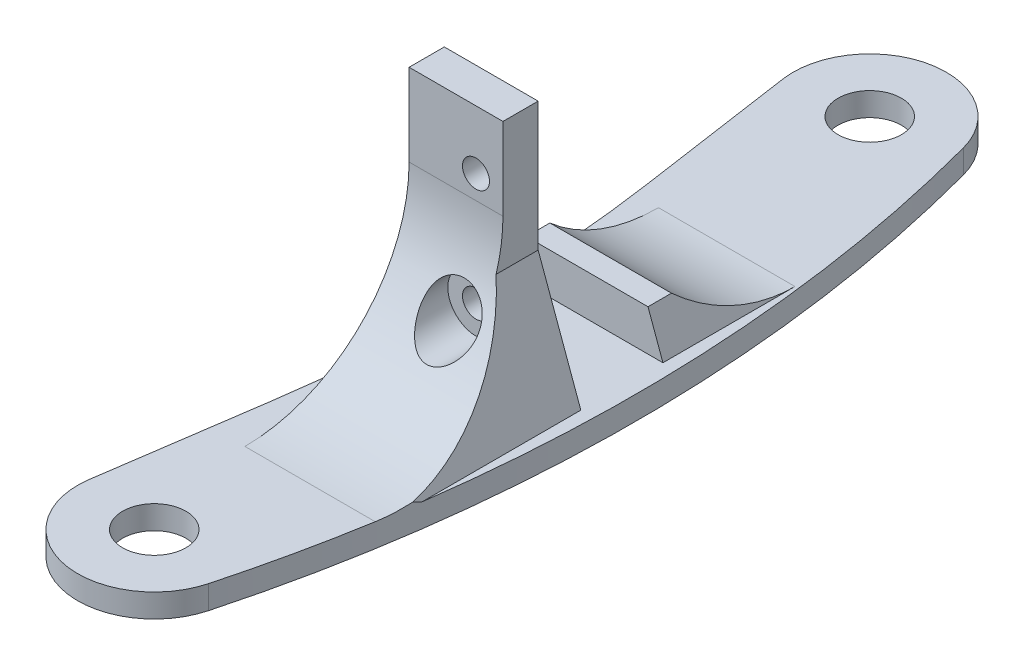
ISO-10303-21;
HEADER;
FILE_DESCRIPTION(('STEP AP214'),'2;1');
FILE_NAME('part.step','',(''),(''),'','','');
FILE_SCHEMA(('AUTOMOTIVE_DESIGN { 1 0 10303 214 1 1 1 1 }'));
ENDSEC;
DATA;
#1=APPLICATION_CONTEXT('core data for automotive mechanical design processes');
#2=APPLICATION_PROTOCOL_DEFINITION('international standard','automotive_design',2000,#1);
#3=PRODUCT_CONTEXT('',#1,'mechanical');
#4=PRODUCT('Part','Part','',(#3));
#5=PRODUCT_RELATED_PRODUCT_CATEGORY('part','',(#4));
#6=PRODUCT_DEFINITION_FORMATION('','',#4);
#7=PRODUCT_DEFINITION_CONTEXT('part definition',#1,'design');
#8=PRODUCT_DEFINITION('design','',#6,#7);
#9=PRODUCT_DEFINITION_SHAPE('','',#8);
#10=(LENGTH_UNIT() NAMED_UNIT(*) SI_UNIT(.MILLI.,.METRE.));
#11=(NAMED_UNIT(*) PLANE_ANGLE_UNIT() SI_UNIT($,.RADIAN.));
#12=(NAMED_UNIT(*) SI_UNIT($,.STERADIAN.) SOLID_ANGLE_UNIT());
#13=UNCERTAINTY_MEASURE_WITH_UNIT(LENGTH_MEASURE(1.E-05),#10,'distance_accuracy_value','');
#14=(GEOMETRIC_REPRESENTATION_CONTEXT(3) GLOBAL_UNCERTAINTY_ASSIGNED_CONTEXT((#13)) GLOBAL_UNIT_ASSIGNED_CONTEXT((#10,
#11,#12)) REPRESENTATION_CONTEXT('',''));
#15=CARTESIAN_POINT('',(0.,0.,0.));
#16=DIRECTION('',(0.,0.,1.));
#17=DIRECTION('',(1.,0.,0.));
#18=AXIS2_PLACEMENT_3D('',#15,#16,#17);
#19=CARTESIAN_POINT('',(8.7,8.4,3.));
#20=DIRECTION('',(0.,0.,-1.));
#21=DIRECTION('',(-1.,0.,0.));
#22=AXIS2_PLACEMENT_3D('',#19,#20,#21);
#23=CYLINDRICAL_SURFACE('',#22,1.15);
#24=CARTESIAN_POINT('',(8.7,8.4,0.));
#25=DIRECTION('',(0.,0.,1.));
#26=DIRECTION('',(1.,0.,0.));
#27=AXIS2_PLACEMENT_3D('',#24,#25,#26);
#28=CIRCLE('',#27,1.15);
#29=CARTESIAN_POINT('',(9.85,8.4,0.));
#30=VERTEX_POINT('',#29);
#31=EDGE_CURVE('E285',#30,#30,#28,.T.);
#32=ORIENTED_EDGE('',*,*,#31,.F.);
#33=EDGE_LOOP('',(#32));
#34=FACE_BOUND('',#33,.T.);
#35=CARTESIAN_POINT('',(8.7,8.4,3.));
#36=DIRECTION('',(0.,0.,1.));
#37=DIRECTION('',(1.,0.,0.));
#38=AXIS2_PLACEMENT_3D('',#35,#36,#37);
#39=CIRCLE('',#38,1.15);
#40=CARTESIAN_POINT('',(9.85,8.4,3.));
#41=VERTEX_POINT('',#40);
#42=EDGE_CURVE('E48',#41,#41,#39,.T.);
#43=ORIENTED_EDGE('',*,*,#42,.T.);
#44=EDGE_LOOP('',(#43));
#45=FACE_BOUND('',#44,.T.);
#46=ADVANCED_FACE('F43',(#34,#45),#23,.F.);
#47=CARTESIAN_POINT('',(0.,16.,17.));
#48=DIRECTION('',(-1.,0.,0.));
#49=DIRECTION('',(0.,0.,1.));
#50=AXIS2_PLACEMENT_3D('',#47,#48,#49);
#51=CYLINDRICAL_SURFACE('',#50,14.);
#52=CARTESIAN_POINT('',(11.,16.,17.));
#53=DIRECTION('',(1.,0.,0.));
#54=DIRECTION('',(0.,1.,0.));
#55=AXIS2_PLACEMENT_3D('',#52,#53,#54);
#56=CIRCLE('',#55,14.);
#57=CARTESIAN_POINT('',(11.,16.,3.));
#58=VERTEX_POINT('',#57);
#59=CARTESIAN_POINT('',(11.,12.,3.58359213500125));
#60=VERTEX_POINT('',#59);
#61=EDGE_CURVE('E346',#58,#60,#56,.F.);
#62=ORIENTED_EDGE('',*,*,#61,.F.);
#63=DIRECTION('',(-1.,0.,0.));
#64=VECTOR('',#63,1.);
#65=CARTESIAN_POINT('',(0.,16.,3.));
#66=LINE('',#65,#64);
#67=CARTESIAN_POINT('',(3.,16.,3.));
#68=VERTEX_POINT('',#67);
#69=EDGE_CURVE('E175',#68,#58,#66,.F.);
#70=ORIENTED_EDGE('',*,*,#69,.F.);
#71=CARTESIAN_POINT('',(3.,16.,17.));
#72=DIRECTION('',(1.,0.,0.));
#73=DIRECTION('',(0.,1.,0.));
#74=AXIS2_PLACEMENT_3D('',#71,#72,#73);
#75=CIRCLE('',#74,14.);
#76=CARTESIAN_POINT('',(3.,2.,17.));
#77=VERTEX_POINT('',#76);
#78=EDGE_CURVE('E174',#77,#68,#75,.T.);
#79=ORIENTED_EDGE('',*,*,#78,.F.);
#80=DIRECTION('',(-1.,0.,0.));
#81=VECTOR('',#80,1.);
#82=CARTESIAN_POINT('',(0.,2.,17.));
#83=LINE('',#82,#81);
#84=CARTESIAN_POINT('',(14.1115614011774,2.,17.));
#85=VERTEX_POINT('',#84);
#86=EDGE_CURVE('E336',#85,#77,#83,.T.);
#87=ORIENTED_EDGE('',*,*,#86,.F.);
#88=CARTESIAN_POINT('',(14.5401718385887,2.2734578124885,14.2464496419222));
#89=CARTESIAN_POINT('',(14.5074147538132,2.22788164891571,14.4736243172497));
#90=CARTESIAN_POINT('',(14.4738643242538,2.18797684885881,14.7018202032177));
#91=CARTESIAN_POINT('',(14.4053200006483,2.11963675914116,15.1591296166361));
#92=CARTESIAN_POINT('',(14.3703298054165,2.09117388275173,15.3882395754655));
#93=CARTESIAN_POINT('',(14.2988897843612,2.04562303292942,15.8473592448937));
#94=CARTESIAN_POINT('',(14.2624399632852,2.02853502250214,16.0773689525639));
#95=CARTESIAN_POINT('',(14.1880679093277,2.00570739783236,16.5382887989223));
#96=CARTESIAN_POINT('',(14.1501423116621,1.99999547924229,16.769199767128));
#97=CARTESIAN_POINT('',(14.1115614011774,2.,17.));
#98=B_SPLINE_CURVE_WITH_KNOTS('',3,(#88,#89,#90,#91,#92,#93,#94,#95,#96,#97),.UNSPECIFIED.,.F.,
.F.,(4,2,2,2,4),(0.,0.701941191961971,1.40217968903493,2.10241590871563,2.80435481398887),.UNSPECIFIED.);
#99=CARTESIAN_POINT('',(14.5401718385887,2.2734578124885,14.2464496419222));
#100=VERTEX_POINT('',#99);
#101=EDGE_CURVE('E11',#85,#100,#98,.F.);
#102=ORIENTED_EDGE('',*,*,#101,.T.);
#103=CARTESIAN_POINT('',(9.54411906293517,16.,17.));
#104=DIRECTION('',(-0.939692620785906,-0.342020143325676,0.));
#105=DIRECTION('',(-0.342020143325676,0.939692620785906,0.));
#106=AXIS2_PLACEMENT_3D('',#103,#104,#105);
#107=ELLIPSE('',#106,14.8984888146628,14.);
#108=EDGE_CURVE('E367',#100,#60,#107,.F.);
#109=ORIENTED_EDGE('',*,*,#108,.T.);
#110=EDGE_LOOP('',(#62,#70,#79,#87,#102,#109));
#111=FACE_BOUND('',#110,.T.);
#112=CARTESIAN_POINT('',(11.1,8.4,5.24244923464075));
#113=CARTESIAN_POINT('',(11.0999978163629,8.54244119249971,5.15037706699407));
#114=CARTESIAN_POINT('',(11.0873178322542,8.68660485831779,5.06088931925991));
#115=CARTESIAN_POINT('',(11.0348081175724,8.97451448164289,4.88923539184177));
#116=CARTESIAN_POINT('',(10.9949752434938,9.1182603888505,4.80707006112368));
#117=CARTESIAN_POINT('',(10.886502849535,9.40114501038631,4.65166733428306));
#118=CARTESIAN_POINT('',(10.8176729395451,9.54024659458632,4.57849315069446));
#119=CARTESIAN_POINT('',(10.651127527389,9.80629279533349,4.4437180242232));
#120=CARTESIAN_POINT('',(10.5534367457631,9.93324769332276,4.38210725035255));
#121=CARTESIAN_POINT('',(10.345254070894,10.1530225641527,4.27892495671697));
#122=CARTESIAN_POINT('',(10.2379409473202,10.2481288331675,4.23580483912122));
#123=CARTESIAN_POINT('',(10.0055912248706,10.4189533804079,4.16019206537776));
#124=CARTESIAN_POINT('',(9.88056691318073,10.4946849984977,4.1276920927333));
#125=CARTESIAN_POINT('',(9.63062228019825,10.6161275384396,4.07646245230454));
#126=CARTESIAN_POINT('',(9.50703381331196,10.664136194664,4.05665479821551));
#127=CARTESIAN_POINT('',(9.25261869306253,10.7392696179903,4.02593422642118));
#128=CARTESIAN_POINT('',(9.12179457546043,10.7664016522949,4.0150182134364));
#129=CARTESIAN_POINT('',(8.86354528243619,10.7977791506682,4.00241688756766));
#130=CARTESIAN_POINT('',(8.73626800298937,10.8030816324184,4.0003051893377));
#131=CARTESIAN_POINT('',(8.48260669624634,10.7934998197342,4.00413975683195));
#132=CARTESIAN_POINT('',(8.35622255700179,10.7786181020231,4.01008499400435));
#133=CARTESIAN_POINT('',(8.1095081431064,10.7295814599924,4.02990491384426));
#134=CARTESIAN_POINT('',(7.98912318420265,10.6956615037693,4.04368295106059));
#135=CARTESIAN_POINT('',(7.75607683292948,10.6100722896021,4.07905540214797));
#136=CARTESIAN_POINT('',(7.64341548475287,10.5584029301099,4.10064986073842));
#137=CARTESIAN_POINT('',(7.42697746938587,10.4383737822311,4.15194099378415));
#138=CARTESIAN_POINT('',(7.32336926066919,10.3697632373679,4.18176026601675));
#139=CARTESIAN_POINT('',(7.12944966412101,10.2189204011747,4.24908138023501));
#140=CARTESIAN_POINT('',(7.03914019657167,10.1366861462742,4.28658432984536));
#141=CARTESIAN_POINT('',(6.8695019838635,9.95731656099081,4.3708181780958));
#142=CARTESIAN_POINT('',(6.79090742684426,9.85965578911892,4.41790533653823));
#143=CARTESIAN_POINT('',(6.65117349200489,9.65601660632025,4.51934213558564));
#144=CARTESIAN_POINT('',(6.59003944301046,9.55003566869077,4.57369398591056));
#145=CARTESIAN_POINT('',(6.4808340339308,9.32331375524282,4.69391512986673));
#146=CARTESIAN_POINT('',(6.43440743062914,9.20209825770471,4.76037879555477));
#147=CARTESIAN_POINT('',(6.36208931894716,8.95722431215415,4.89962021199369));
#148=CARTESIAN_POINT('',(6.33620807924995,8.83356467415155,4.97240109999265));
#149=CARTESIAN_POINT('',(6.30196303499879,8.57078957970917,5.13267338239141));
#150=CARTESIAN_POINT('',(6.29629617775166,8.43174257505201,5.22085018638713));
#151=CARTESIAN_POINT('',(6.3083285291836,8.15760173422938,5.40156030523669));
#152=CARTESIAN_POINT('',(6.32603596676781,8.02250930738801,5.49409514327208));
#153=CARTESIAN_POINT('',(6.38735764345811,7.74014538790832,5.6947424588458));
#154=CARTESIAN_POINT('',(6.43427308914361,7.59384290181965,5.80321150271188));
#155=CARTESIAN_POINT('',(6.5551284557511,7.31231935194898,6.02020825698028));
#156=CARTESIAN_POINT('',(6.62912011390968,7.17712011388705,6.12873567985279));
#157=CARTESIAN_POINT('',(6.76313586682456,6.9803214483234,6.29236416931398));
#158=CARTESIAN_POINT('',(6.81384452643834,6.91355315451892,6.34900488541206));
#159=CARTESIAN_POINT('',(6.9229030186514,6.78474062782615,6.46025304307662));
#160=CARTESIAN_POINT('',(6.98125522260552,6.72269787048765,6.5148598468559));
#161=CARTESIAN_POINT('',(7.16759007996512,6.54498812802257,6.67393213720524));
#162=CARTESIAN_POINT('',(7.30729481110164,6.43707303186333,6.77421085174035));
#163=CARTESIAN_POINT('',(7.55076278628351,6.29051470748584,6.91379870178202));
#164=CARTESIAN_POINT('',(7.644281163479,6.24200143705189,6.96082260168323));
#165=CARTESIAN_POINT('',(7.84077143490486,6.15652420952283,7.04462305748376));
#166=CARTESIAN_POINT('',(7.94373372231887,6.11954868061831,7.08140987665805));
#167=CARTESIAN_POINT('',(8.15872853767651,6.05915324412875,7.14193357810842));
#168=CARTESIAN_POINT('',(8.27084665681284,6.03588330040759,7.16552595329748));
#169=CARTESIAN_POINT('',(8.44213879927582,6.01319263883025,7.18858945059425));
#170=CARTESIAN_POINT('',(8.49976034330525,6.0076648431187,7.19422306055811));
#171=CARTESIAN_POINT('',(8.61550511411941,6.00078778249784,7.20123579249863));
#172=CARTESIAN_POINT('',(8.67362825799798,5.99943783983762,7.2026156045462));
#173=CARTESIAN_POINT('',(8.83043291115097,6.00152108883963,7.20048718738362));
#174=CARTESIAN_POINT('',(8.92905831235851,6.00895848391595,7.19288680401204));
#175=CARTESIAN_POINT('',(9.12298520949786,6.03553531124331,7.16588685507965));
#176=CARTESIAN_POINT('',(9.21828570952686,6.05467821835473,7.14648378582068));
#177=CARTESIAN_POINT('',(9.40263508343584,6.10319371924981,7.09775871699768));
#178=CARTESIAN_POINT('',(9.49172870009721,6.13248139538843,7.06851911172332));
#179=CARTESIAN_POINT('',(9.6632852106402,6.19986528460578,7.00201996009368));
#180=CARTESIAN_POINT('',(9.7457450892557,6.23796547312986,6.96475679472589));
#181=CARTESIAN_POINT('',(9.94735900821552,6.34491060180118,6.86158974681383));
#182=CARTESIAN_POINT('',(10.0614487937121,6.41907678544422,6.7912751737942));
#183=CARTESIAN_POINT('',(10.2720092725959,6.58160431094024,6.64113183117516));
#184=CARTESIAN_POINT('',(10.3684315465769,6.67000345126075,6.56127787775185));
#185=CARTESIAN_POINT('',(10.5678095168561,6.88403930911127,6.37339988917547));
#186=CARTESIAN_POINT('',(10.6653170357472,7.01324262948346,6.26365214365762));
#187=CARTESIAN_POINT('',(10.8318825506786,7.28616633006131,6.04097791711156));
#188=CARTESIAN_POINT('',(10.9009460784337,7.42988388080038,5.92805205872268));
#189=CARTESIAN_POINT('',(11.0025411584858,7.70907989595062,5.71784214150685));
#190=CARTESIAN_POINT('',(11.0386718158187,7.84317355126114,5.62044588134256));
#191=CARTESIAN_POINT('',(11.0873957744256,8.11760946335743,5.42866048599273));
#192=CARTESIAN_POINT('',(11.1000021776677,8.25794819728821,5.33426970570159));
#193=CARTESIAN_POINT('',(11.1,8.4,5.24244923464075));
#194=B_SPLINE_CURVE_WITH_KNOTS('',3,(#112,#113,#114,#115,#116,#117,#118,#119,#120,#121,#122,
#123,#124,#125,#126,#127,#128,#129,#130,#131,#132,#133,#134,#135,#136,#137,#138,#139,#140,#141,
#142,#143,#144,#145,#146,#147,#148,#149,#150,#151,#152,#153,#154,#155,#156,#157,#158,#159,#160,
#161,#162,#163,#164,#165,#166,#167,#168,#169,#170,#171,#172,#173,#174,#175,#176,#177,#178,#179,
#180,#181,#182,#183,#184,#185,#186,#187,#188,#189,#190,#191,#192,#193),.UNSPECIFIED.,.T.,.F.,(4,
2,2,2,2,2,2,2,2,2,2,2,2,2,2,2,2,2,2,2,2,2,2,2,2,2,2,2,2,2,2,2,2,2,2,2,2,2,2,2,4),(0.,
0.508314383690139,1.01668762522415,1.52845211008269,2.03977951197279,2.48647639231094,
2.9328648794355,3.33299459928753,3.73298496991995,4.11336157896304,4.49368963353976,
4.8694237877245,5.2451600915981,5.62683169257331,6.00855835139111,6.40858924558842,
6.80874209629514,7.24447402802168,7.68042360403197,8.17272791320527,8.66520558401842,
9.22713177003602,9.79013733983047,10.0932893541041,10.3965356428624,11.0001348720766,
11.3451329425078,11.6897838756686,12.0381390366313,12.2123460718361,12.3865248448769,
12.6824861539082,12.9785353637363,13.2721640729402,13.5659255013254,14.0228840887816,
14.4810768689523,15.0648079052403,15.6484253653437,16.1556327525422,16.6625575632683),.UNSPECIFIED.);
#195=CARTESIAN_POINT('',(11.1,8.4,5.24244923464075));
#196=VERTEX_POINT('',#195);
#197=EDGE_CURVE('E383',#196,#196,#194,.T.);
#198=ORIENTED_EDGE('',*,*,#197,.F.);
#199=EDGE_LOOP('',(#198));
#200=FACE_BOUND('',#199,.T.);
#201=ADVANCED_FACE('F392',(#111,#200),#51,.F.);
#202=CARTESIAN_POINT('',(0.,2.,3.));
#203=DIRECTION('',(0.,-1.,0.));
#204=DIRECTION('',(0.,0.,-1.));
#205=AXIS2_PLACEMENT_3D('',#202,#203,#204);
#206=PLANE('',#205);
#207=DIRECTION('',(-1.,0.,0.));
#208=VECTOR('',#207,1.);
#209=CARTESIAN_POINT('',(0.,2.,0.));
#210=LINE('',#209,#208);
#211=CARTESIAN_POINT('',(14.6397023426621,2.,0.));
#212=VERTEX_POINT('',#211);
#213=CARTESIAN_POINT('',(3.,2.,0.));
#214=VERTEX_POINT('',#213);
#215=EDGE_CURVE('E317',#212,#214,#210,.T.);
#216=ORIENTED_EDGE('',*,*,#215,.F.);
#217=DIRECTION('',(0.,0.,1.));
#218=VECTOR('',#217,1.);
#219=CARTESIAN_POINT('',(14.6397023426621,2.,3.));
#220=LINE('',#219,#218);
#221=CARTESIAN_POINT('',(14.6397023426621,2.,13.5419793522471));
#222=VERTEX_POINT('',#221);
#223=EDGE_CURVE('E358',#212,#222,#220,.T.);
#224=ORIENTED_EDGE('',*,*,#223,.T.);
#225=CARTESIAN_POINT('',(-108.563860267939,2.,-3.50546822807987));
#226=DIRECTION('',(0.,-1.,0.));
#227=DIRECTION('',(0.,0.,-1.));
#228=AXIS2_PLACEMENT_3D('',#225,#226,#227);
#229=CIRCLE('',#228,124.377382626217);
#230=CARTESIAN_POINT('',(11.5754658169605,2.,-35.6967036317499));
#231=VERTEX_POINT('',#230);
#232=EDGE_CURVE('E261',#231,#222,#229,.T.);
#233=ORIENTED_EDGE('',*,*,#232,.F.);
#234=CARTESIAN_POINT('',(5.26629300493794,2.,-34.0061658718599));
#235=DIRECTION('',(0.,-1.,0.));
#236=DIRECTION('',(0.,0.,-1.));
#237=AXIS2_PLACEMENT_3D('',#234,#235,#236);
#238=CIRCLE('',#237,6.53173633037786);
#239=CARTESIAN_POINT('',(-1.19704342161867,2.,-33.0633712353009));
#240=VERTEX_POINT('',#239);
#241=EDGE_CURVE('E250',#240,#231,#238,.T.);
#242=ORIENTED_EDGE('',*,*,#241,.F.);
#243=DIRECTION('',(-0.144340584015041,0.,-0.989528067214971));
#244=VECTOR('',#243,1.);
#245=CARTESIAN_POINT('',(0.787781868680061,2.,-19.4563850458586));
#246=LINE('',#245,#244);
#247=CARTESIAN_POINT('',(0.78778186868006,2.,-19.4563850458586));
#248=VERTEX_POINT('',#247);
#249=EDGE_CURVE('E241',#248,#240,#246,.T.);
#250=ORIENTED_EDGE('',*,*,#249,.F.);
#251=CARTESIAN_POINT('',(-108.563860267939,2.,-3.50546822807987));
#252=DIRECTION('',(0.,-1.,0.));
#253=DIRECTION('',(0.,0.,-1.));
#254=AXIS2_PLACEMENT_3D('',#251,#252,#253);
#255=CIRCLE('',#254,110.508883739286);
#256=CARTESIAN_POINT('',(0.78778186868006,2.,12.4454485896989));
#257=VERTEX_POINT('',#256);
#258=EDGE_CURVE('E235',#257,#248,#255,.F.);
#259=ORIENTED_EDGE('',*,*,#258,.F.);
#260=DIRECTION('',(0.144340584015041,0.,-0.989528067214971));
#261=VECTOR('',#260,1.);
#262=CARTESIAN_POINT('',(0.787781868680059,2.,12.4454485896989));
#263=LINE('',#262,#261);
#264=CARTESIAN_POINT('',(-1.19704342161867,2.,26.0524347791412));
#265=VERTEX_POINT('',#264);
#266=EDGE_CURVE('E229',#265,#257,#263,.T.);
#267=ORIENTED_EDGE('',*,*,#266,.F.);
#268=CARTESIAN_POINT('',(5.26629300493794,2.,26.9952294157002));
#269=DIRECTION('',(0.,-1.,0.));
#270=DIRECTION('',(0.,0.,-1.));
#271=AXIS2_PLACEMENT_3D('',#268,#269,#270);
#272=CIRCLE('',#271,6.53173633037786);
#273=CARTESIAN_POINT('',(11.5754658169605,2.,28.6857671755901));
#274=VERTEX_POINT('',#273);
#275=EDGE_CURVE('E223',#274,#265,#272,.T.);
#276=ORIENTED_EDGE('',*,*,#275,.F.);
#277=EDGE_CURVE('E217',#85,#274,#229,.T.);
#278=ORIENTED_EDGE('',*,*,#277,.F.);
#279=ORIENTED_EDGE('',*,*,#86,.T.);
#280=DIRECTION('',(0.,0.,-1.));
#281=VECTOR('',#280,1.);
#282=CARTESIAN_POINT('',(3.,2.,3.));
#283=LINE('',#282,#281);
#284=EDGE_CURVE('E332',#77,#214,#283,.T.);
#285=ORIENTED_EDGE('',*,*,#284,.T.);
#286=EDGE_LOOP('',(#216,#224,#233,#242,#250,#259,#267,#276,#278,#279,#285));
#287=FACE_BOUND('',#286,.T.);
#288=CARTESIAN_POINT('',(5.26629300493794,2.,-34.0061658718599));
#289=DIRECTION('',(0.,-1.,0.));
#290=DIRECTION('',(0.,0.,-1.));
#291=AXIS2_PLACEMENT_3D('',#288,#289,#290);
#292=CIRCLE('',#291,2.7);
#293=CARTESIAN_POINT('',(5.26629300493794,2.,-36.7061658718599));
#294=VERTEX_POINT('',#293);
#295=EDGE_CURVE('E281',#294,#294,#292,.T.);
#296=ORIENTED_EDGE('',*,*,#295,.T.);
#297=EDGE_LOOP('',(#296));
#298=FACE_BOUND('',#297,.T.);
#299=CARTESIAN_POINT('',(5.26629300493794,2.,26.9952294157002));
#300=DIRECTION('',(0.,-1.,0.));
#301=DIRECTION('',(0.,0.,-1.));
#302=AXIS2_PLACEMENT_3D('',#299,#300,#301);
#303=CIRCLE('',#302,2.7);
#304=CARTESIAN_POINT('',(5.26629300493794,2.,24.2952294157002));
#305=VERTEX_POINT('',#304);
#306=EDGE_CURVE('E211',#305,#305,#303,.T.);
#307=ORIENTED_EDGE('',*,*,#306,.T.);
#308=EDGE_LOOP('',(#307));
#309=FACE_BOUND('',#308,.T.);
#310=DIRECTION('',(0.,0.,1.));
#311=VECTOR('',#310,1.);
#312=CARTESIAN_POINT('',(14.6397023426621,2.,-7.));
#313=LINE('',#312,#311);
#314=CARTESIAN_POINT('',(14.6397023426621,2.,-18.2601295887261));
#315=VERTEX_POINT('',#314);
#316=CARTESIAN_POINT('',(14.6397023426621,2.,-7.));
#317=VERTEX_POINT('',#316);
#318=EDGE_CURVE('E354',#315,#317,#313,.T.);
#319=ORIENTED_EDGE('',*,*,#318,.T.);
#320=DIRECTION('',(-1.,0.,0.));
#321=VECTOR('',#320,1.);
#322=CARTESIAN_POINT('',(0.,2.,-7.));
#323=LINE('',#322,#321);
#324=CARTESIAN_POINT('',(3.,2.,-7.));
#325=VERTEX_POINT('',#324);
#326=EDGE_CURVE('E191',#317,#325,#323,.T.);
#327=ORIENTED_EDGE('',*,*,#326,.T.);
#328=DIRECTION('',(0.,0.,1.));
#329=VECTOR('',#328,1.);
#330=CARTESIAN_POINT('',(3.,2.,-9.));
#331=LINE('',#330,#329);
#332=CARTESIAN_POINT('',(3.,2.,-18.2601295887261));
#333=VERTEX_POINT('',#332);
#334=EDGE_CURVE('E184',#333,#325,#331,.T.);
#335=ORIENTED_EDGE('',*,*,#334,.F.);
#336=DIRECTION('',(-1.,0.,0.));
#337=VECTOR('',#336,1.);
#338=CARTESIAN_POINT('',(0.,2.,-18.2601295887261));
#339=LINE('',#338,#337);
#340=EDGE_CURVE('E170',#333,#315,#339,.F.);
#341=ORIENTED_EDGE('',*,*,#340,.T.);
#342=EDGE_LOOP('',(#319,#327,#335,#341));
#343=FACE_BOUND('',#342,.T.);
#344=ADVANCED_FACE('F396',(#287,#298,#309,#343),#206,.F.);
#345=CARTESIAN_POINT('',(3.,0.,3.));
#346=DIRECTION('',(1.,0.,0.));
#347=DIRECTION('',(0.,1.,0.));
#348=AXIS2_PLACEMENT_3D('',#345,#346,#347);
#349=PLANE('',#348);
#350=DIRECTION('',(0.,-1.,0.));
#351=VECTOR('',#350,1.);
#352=CARTESIAN_POINT('',(3.,0.,0.));
#353=LINE('',#352,#351);
#354=CARTESIAN_POINT('',(3.,23.,0.));
#355=VERTEX_POINT('',#354);
#356=EDGE_CURVE('E313',#355,#214,#353,.T.);
#357=ORIENTED_EDGE('',*,*,#356,.T.);
#358=ORIENTED_EDGE('',*,*,#284,.F.);
#359=ORIENTED_EDGE('',*,*,#78,.T.);
#360=DIRECTION('',(0.,-1.,0.));
#361=VECTOR('',#360,1.);
#362=CARTESIAN_POINT('',(3.,0.,3.));
#363=LINE('',#362,#361);
#364=CARTESIAN_POINT('',(3.,23.,3.));
#365=VERTEX_POINT('',#364);
#366=EDGE_CURVE('E293',#365,#68,#363,.T.);
#367=ORIENTED_EDGE('',*,*,#366,.F.);
#368=DIRECTION('',(0.,0.,-1.));
#369=VECTOR('',#368,1.);
#370=CARTESIAN_POINT('',(3.,23.,3.));
#371=LINE('',#370,#369);
#372=EDGE_CURVE('E305',#365,#355,#371,.T.);
#373=ORIENTED_EDGE('',*,*,#372,.T.);
#374=EDGE_LOOP('',(#357,#358,#359,#367,#373));
#375=FACE_BOUND('',#374,.T.);
#376=ADVANCED_FACE('F426',(#375),#349,.F.);
#377=CARTESIAN_POINT('',(11.,0.,3.));
#378=DIRECTION('',(1.,0.,0.));
#379=DIRECTION('',(0.,1.,0.));
#380=AXIS2_PLACEMENT_3D('',#377,#378,#379);
#381=PLANE('',#380);
#382=ORIENTED_EDGE('',*,*,#61,.T.);
#383=DIRECTION('',(0.,0.,-1.));
#384=VECTOR('',#383,1.);
#385=CARTESIAN_POINT('',(11.,12.,3.));
#386=LINE('',#385,#384);
#387=CARTESIAN_POINT('',(11.,12.,0.));
#388=VERTEX_POINT('',#387);
#389=EDGE_CURVE('E350',#60,#388,#386,.T.);
#390=ORIENTED_EDGE('',*,*,#389,.T.);
#391=DIRECTION('',(0.,-1.,0.));
#392=VECTOR('',#391,1.);
#393=CARTESIAN_POINT('',(11.,0.,0.));
#394=LINE('',#393,#392);
#395=CARTESIAN_POINT('',(11.,23.,0.));
#396=VERTEX_POINT('',#395);
#397=EDGE_CURVE('E320',#396,#388,#394,.T.);
#398=ORIENTED_EDGE('',*,*,#397,.F.);
#399=DIRECTION('',(0.,0.,-1.));
#400=VECTOR('',#399,1.);
#401=CARTESIAN_POINT('',(11.,23.,3.));
#402=LINE('',#401,#400);
#403=CARTESIAN_POINT('',(11.,23.,3.));
#404=VERTEX_POINT('',#403);
#405=EDGE_CURVE('E329',#404,#396,#402,.T.);
#406=ORIENTED_EDGE('',*,*,#405,.F.);
#407=DIRECTION('',(0.,-1.,0.));
#408=VECTOR('',#407,1.);
#409=CARTESIAN_POINT('',(11.,0.,3.));
#410=LINE('',#409,#408);
#411=EDGE_CURVE('E298',#404,#58,#410,.T.);
#412=ORIENTED_EDGE('',*,*,#411,.T.);
#413=EDGE_LOOP('',(#382,#390,#398,#406,#412));
#414=FACE_BOUND('',#413,.T.);
#415=ADVANCED_FACE('F424',(#414),#381,.T.);
#416=CARTESIAN_POINT('',(8.7,18.,3.));
#417=DIRECTION('',(0.,0.,-1.));
#418=DIRECTION('',(-1.,0.,0.));
#419=AXIS2_PLACEMENT_3D('',#416,#417,#418);
#420=CYLINDRICAL_SURFACE('',#419,1.15);
#421=CARTESIAN_POINT('',(8.7,18.,3.));
#422=DIRECTION('',(0.,0.,1.));
#423=DIRECTION('',(1.,0.,0.));
#424=AXIS2_PLACEMENT_3D('',#421,#422,#423);
#425=CIRCLE('',#424,1.15);
#426=CARTESIAN_POINT('',(9.85,18.,3.));
#427=VERTEX_POINT('',#426);
#428=EDGE_CURVE('E289',#427,#427,#425,.T.);
#429=ORIENTED_EDGE('',*,*,#428,.T.);
#430=EDGE_LOOP('',(#429));
#431=FACE_BOUND('',#430,.T.);
#432=CARTESIAN_POINT('',(8.7,18.,0.));
#433=DIRECTION('',(0.,0.,1.));
#434=DIRECTION('',(1.,0.,0.));
#435=AXIS2_PLACEMENT_3D('',#432,#433,#434);
#436=CIRCLE('',#435,1.15);
#437=CARTESIAN_POINT('',(9.85,18.,0.));
#438=VERTEX_POINT('',#437);
#439=EDGE_CURVE('E309',#438,#438,#436,.T.);
#440=ORIENTED_EDGE('',*,*,#439,.F.);
#441=EDGE_LOOP('',(#440));
#442=FACE_BOUND('',#441,.T.);
#443=ADVANCED_FACE('F420',(#431,#442),#420,.F.);
#444=CARTESIAN_POINT('',(0.,23.,3.));
#445=DIRECTION('',(0.,-1.,0.));
#446=DIRECTION('',(0.,0.,-1.));
#447=AXIS2_PLACEMENT_3D('',#444,#445,#446);
#448=PLANE('',#447);
#449=DIRECTION('',(-1.,0.,0.));
#450=VECTOR('',#449,1.);
#451=CARTESIAN_POINT('',(0.,23.,0.));
#452=LINE('',#451,#450);
#453=EDGE_CURVE('E294',#396,#355,#452,.T.);
#454=ORIENTED_EDGE('',*,*,#453,.T.);
#455=ORIENTED_EDGE('',*,*,#372,.F.);
#456=DIRECTION('',(-1.,0.,0.));
#457=VECTOR('',#456,1.);
#458=CARTESIAN_POINT('',(0.,23.,3.));
#459=LINE('',#458,#457);
#460=EDGE_CURVE('E302',#404,#365,#459,.T.);
#461=ORIENTED_EDGE('',*,*,#460,.F.);
#462=ORIENTED_EDGE('',*,*,#405,.T.);
#463=EDGE_LOOP('',(#454,#455,#461,#462));
#464=FACE_BOUND('',#463,.T.);
#465=ADVANCED_FACE('F423',(#464),#448,.F.);
#466=CARTESIAN_POINT('',(0.,0.,3.));
#467=DIRECTION('',(0.,0.,1.));
#468=DIRECTION('',(1.,0.,0.));
#469=AXIS2_PLACEMENT_3D('',#466,#467,#468);
#470=PLANE('',#469);
#471=ORIENTED_EDGE('',*,*,#428,.F.);
#472=EDGE_LOOP('',(#471));
#473=FACE_BOUND('',#472,.T.);
#474=ORIENTED_EDGE('',*,*,#366,.T.);
#475=ORIENTED_EDGE('',*,*,#69,.T.);
#476=ORIENTED_EDGE('',*,*,#411,.F.);
#477=ORIENTED_EDGE('',*,*,#460,.T.);
#478=EDGE_LOOP('',(#474,#475,#476,#477));
#479=FACE_BOUND('',#478,.T.);
#480=ADVANCED_FACE('F435',(#473,#479),#470,.T.);
#481=CARTESIAN_POINT('',(0.,0.,0.));
#482=DIRECTION('',(0.,0.,1.));
#483=DIRECTION('',(1.,0.,0.));
#484=AXIS2_PLACEMENT_3D('',#481,#482,#483);
#485=PLANE('',#484);
#486=ORIENTED_EDGE('',*,*,#31,.T.);
#487=EDGE_LOOP('',(#486));
#488=FACE_BOUND('',#487,.T.);
#489=ORIENTED_EDGE('',*,*,#439,.T.);
#490=EDGE_LOOP('',(#489));
#491=FACE_BOUND('',#490,.T.);
#492=ORIENTED_EDGE('',*,*,#356,.F.);
#493=ORIENTED_EDGE('',*,*,#453,.F.);
#494=ORIENTED_EDGE('',*,*,#397,.T.);
#495=DIRECTION('',(0.342020143325676,-0.939692620785906,0.));
#496=VECTOR('',#495,1.);
#497=CARTESIAN_POINT('',(13.5699700952736,4.93906519456222,0.));
#498=LINE('',#497,#496);
#499=EDGE_CURVE('E361',#388,#212,#498,.T.);
#500=ORIENTED_EDGE('',*,*,#499,.T.);
#501=ORIENTED_EDGE('',*,*,#215,.T.);
#502=EDGE_LOOP('',(#492,#493,#494,#500,#501));
#503=FACE_BOUND('',#502,.T.);
#504=ADVANCED_FACE('F437',(#488,#491,#503),#485,.F.);
#505=CARTESIAN_POINT('',(5.26629300493794,0.,-34.0061658718599));
#506=DIRECTION('',(0.,-1.,0.));
#507=DIRECTION('',(0.,0.,-1.));
#508=AXIS2_PLACEMENT_3D('',#505,#506,#507);
#509=PLANE('',#508);
#510=CARTESIAN_POINT('',(5.26629300493794,0.,-34.0061658718599));
#511=DIRECTION('',(0.,1.,0.));
#512=DIRECTION('',(0.,0.,1.));
#513=AXIS2_PLACEMENT_3D('',#510,#511,#512);
#514=CIRCLE('',#513,2.7);
#515=CARTESIAN_POINT('',(5.26629300493794,0.,-31.3061658718599));
#516=VERTEX_POINT('',#515);
#517=EDGE_CURVE('E205',#516,#516,#514,.T.);
#518=ORIENTED_EDGE('',*,*,#517,.T.);
#519=EDGE_LOOP('',(#518));
#520=FACE_BOUND('',#519,.T.);
#521=CARTESIAN_POINT('',(5.26629300493794,0.,-34.0061658718599));
#522=DIRECTION('',(0.,1.,0.));
#523=DIRECTION('',(0.,0.,-1.));
#524=AXIS2_PLACEMENT_3D('',#521,#522,#523);
#525=CIRCLE('',#524,6.53173633037786);
#526=CARTESIAN_POINT('',(11.5754658169605,0.,-35.6967036317499));
#527=VERTEX_POINT('',#526);
#528=CARTESIAN_POINT('',(-1.19704342161867,0.,-33.0633712353009));
#529=VERTEX_POINT('',#528);
#530=EDGE_CURVE('E237',#527,#529,#525,.T.);
#531=ORIENTED_EDGE('',*,*,#530,.F.);
#532=CARTESIAN_POINT('',(-108.563860267939,0.,-3.50546822807987));
#533=DIRECTION('',(0.,1.,0.));
#534=DIRECTION('',(0.,0.,1.));
#535=AXIS2_PLACEMENT_3D('',#532,#533,#534);
#536=CIRCLE('',#535,124.377382626217);
#537=CARTESIAN_POINT('',(11.5754658169605,0.,28.6857671755901));
#538=VERTEX_POINT('',#537);
#539=EDGE_CURVE('E207',#538,#527,#536,.T.);
#540=ORIENTED_EDGE('',*,*,#539,.F.);
#541=CARTESIAN_POINT('',(5.26629300493794,0.,26.9952294157002));
#542=DIRECTION('',(0.,1.,0.));
#543=DIRECTION('',(0.,0.,1.));
#544=AXIS2_PLACEMENT_3D('',#541,#542,#543);
#545=CIRCLE('',#544,6.53173633037786);
#546=CARTESIAN_POINT('',(-1.19704342161867,0.,26.0524347791412));
#547=VERTEX_POINT('',#546);
#548=EDGE_CURVE('E213',#547,#538,#545,.T.);
#549=ORIENTED_EDGE('',*,*,#548,.F.);
#550=DIRECTION('',(-0.144340584015041,0.,0.989528067214972));
#551=VECTOR('',#550,1.);
#552=CARTESIAN_POINT('',(0.78778186868006,0.,12.4454485896989));
#553=LINE('',#552,#551);
#554=CARTESIAN_POINT('',(0.78778186868006,0.,12.4454485896989));
#555=VERTEX_POINT('',#554);
#556=EDGE_CURVE('E219',#555,#547,#553,.T.);
#557=ORIENTED_EDGE('',*,*,#556,.F.);
#558=CARTESIAN_POINT('',(-108.563860267939,0.,-3.50546822807987));
#559=DIRECTION('',(0.,-1.,0.));
#560=DIRECTION('',(0.,0.,1.));
#561=AXIS2_PLACEMENT_3D('',#558,#559,#560);
#562=CIRCLE('',#561,110.508883739286);
#563=CARTESIAN_POINT('',(0.78778186868006,0.,-19.4563850458586));
#564=VERTEX_POINT('',#563);
#565=EDGE_CURVE('E225',#564,#555,#562,.T.);
#566=ORIENTED_EDGE('',*,*,#565,.F.);
#567=DIRECTION('',(0.144340584015041,0.,0.989528067214971));
#568=VECTOR('',#567,1.);
#569=CARTESIAN_POINT('',(0.78778186868006,0.,-19.4563850458586));
#570=LINE('',#569,#568);
#571=EDGE_CURVE('E231',#529,#564,#570,.T.);
#572=ORIENTED_EDGE('',*,*,#571,.F.);
#573=EDGE_LOOP('',(#531,#540,#549,#557,#566,#572));
#574=FACE_BOUND('',#573,.T.);
#575=CARTESIAN_POINT('',(5.26629300493794,0.,26.9952294157002));
#576=DIRECTION('',(0.,1.,0.));
#577=DIRECTION('',(0.,0.,1.));
#578=AXIS2_PLACEMENT_3D('',#575,#576,#577);
#579=CIRCLE('',#578,2.7);
#580=CARTESIAN_POINT('',(5.26629300493794,0.,29.6952294157002));
#581=VERTEX_POINT('',#580);
#582=EDGE_CURVE('E246',#581,#581,#579,.T.);
#583=ORIENTED_EDGE('',*,*,#582,.T.);
#584=EDGE_LOOP('',(#583));
#585=FACE_BOUND('',#584,.T.);
#586=ADVANCED_FACE('F440',(#520,#574,#585),#509,.T.);
#587=CARTESIAN_POINT('',(5.26629300493794,78.0085240813625,-34.0061658718599));
#588=DIRECTION('',(0.,-1.,0.));
#589=DIRECTION('',(0.,0.,-1.));
#590=AXIS2_PLACEMENT_3D('',#587,#588,#589);
#591=CYLINDRICAL_SURFACE('',#590,6.53173633037786);
#592=DIRECTION('',(0.,-1.,0.));
#593=VECTOR('',#592,1.);
#594=CARTESIAN_POINT('',(-1.19704342161867,78.0085240813625,-33.0633712353009));
#595=LINE('',#594,#593);
#596=EDGE_CURVE('E236',#240,#529,#595,.T.);
#597=ORIENTED_EDGE('',*,*,#596,.F.);
#598=ORIENTED_EDGE('',*,*,#241,.T.);
#599=DIRECTION('',(0.,-1.,0.));
#600=VECTOR('',#599,1.);
#601=CARTESIAN_POINT('',(11.5754658169605,78.0085240813625,-35.6967036317499));
#602=LINE('',#601,#600);
#603=EDGE_CURVE('E242',#231,#527,#602,.T.);
#604=ORIENTED_EDGE('',*,*,#603,.T.);
#605=ORIENTED_EDGE('',*,*,#530,.T.);
#606=EDGE_LOOP('',(#597,#598,#604,#605));
#607=FACE_BOUND('',#606,.T.);
#608=ADVANCED_FACE('F453',(#607),#591,.T.);
#609=CARTESIAN_POINT('',(0.78778186868006,78.0085240813625,-19.4563850458586));
#610=DIRECTION('',(0.989528067214971,0.,-0.144340584015041));
#611=DIRECTION('',(-0.144340584015041,0.,-0.989528067214971));
#612=AXIS2_PLACEMENT_3D('',#609,#610,#611);
#613=PLANE('',#612);
#614=DIRECTION('',(0.,-1.,0.));
#615=VECTOR('',#614,1.);
#616=CARTESIAN_POINT('',(0.78778186868006,78.0085240813625,-19.4563850458586));
#617=LINE('',#616,#615);
#618=EDGE_CURVE('E230',#248,#564,#617,.T.);
#619=ORIENTED_EDGE('',*,*,#618,.F.);
#620=ORIENTED_EDGE('',*,*,#249,.T.);
#621=ORIENTED_EDGE('',*,*,#596,.T.);
#622=ORIENTED_EDGE('',*,*,#571,.T.);
#623=EDGE_LOOP('',(#619,#620,#621,#622));
#624=FACE_BOUND('',#623,.T.);
#625=ADVANCED_FACE('F456',(#624),#613,.F.);
#626=CARTESIAN_POINT('',(-108.563860267939,78.0085240813625,-3.50546822807986));
#627=DIRECTION('',(0.,-1.,0.));
#628=DIRECTION('',(0.,0.,-1.));
#629=AXIS2_PLACEMENT_3D('',#626,#627,#628);
#630=CYLINDRICAL_SURFACE('',#629,110.508883739286);
#631=DIRECTION('',(0.,-1.,0.));
#632=VECTOR('',#631,1.);
#633=CARTESIAN_POINT('',(0.78778186868006,78.0085240813625,12.4454485896989));
#634=LINE('',#633,#632);
#635=EDGE_CURVE('E224',#257,#555,#634,.T.);
#636=ORIENTED_EDGE('',*,*,#635,.F.);
#637=ORIENTED_EDGE('',*,*,#258,.T.);
#638=ORIENTED_EDGE('',*,*,#618,.T.);
#639=ORIENTED_EDGE('',*,*,#565,.T.);
#640=EDGE_LOOP('',(#636,#637,#638,#639));
#641=FACE_BOUND('',#640,.T.);
#642=ADVANCED_FACE('F460',(#641),#630,.F.);
#643=CARTESIAN_POINT('',(0.78778186868006,78.0085240813625,12.4454485896989));
#644=DIRECTION('',(0.989528067214971,0.,0.144340584015041));
#645=DIRECTION('',(0.144340584015041,0.,-0.989528067214971));
#646=AXIS2_PLACEMENT_3D('',#643,#644,#645);
#647=PLANE('',#646);
#648=DIRECTION('',(0.,-1.,0.));
#649=VECTOR('',#648,1.);
#650=CARTESIAN_POINT('',(-1.19704342161867,78.0085240813625,26.0524347791412));
#651=LINE('',#650,#649);
#652=EDGE_CURVE('E218',#265,#547,#651,.T.);
#653=ORIENTED_EDGE('',*,*,#652,.F.);
#654=ORIENTED_EDGE('',*,*,#266,.T.);
#655=ORIENTED_EDGE('',*,*,#635,.T.);
#656=ORIENTED_EDGE('',*,*,#556,.T.);
#657=EDGE_LOOP('',(#653,#654,#655,#656));
#658=FACE_BOUND('',#657,.T.);
#659=ADVANCED_FACE('F464',(#658),#647,.F.);
#660=CARTESIAN_POINT('',(5.26629300493794,78.0085240813625,26.9952294157002));
#661=DIRECTION('',(0.,-1.,0.));
#662=DIRECTION('',(0.,0.,-1.));
#663=AXIS2_PLACEMENT_3D('',#660,#661,#662);
#664=CYLINDRICAL_SURFACE('',#663,6.53173633037786);
#665=DIRECTION('',(0.,-1.,0.));
#666=VECTOR('',#665,1.);
#667=CARTESIAN_POINT('',(11.5754658169605,78.0085240813625,28.6857671755901));
#668=LINE('',#667,#666);
#669=EDGE_CURVE('E212',#274,#538,#668,.T.);
#670=ORIENTED_EDGE('',*,*,#669,.F.);
#671=ORIENTED_EDGE('',*,*,#275,.T.);
#672=ORIENTED_EDGE('',*,*,#652,.T.);
#673=ORIENTED_EDGE('',*,*,#548,.T.);
#674=EDGE_LOOP('',(#670,#671,#672,#673));
#675=FACE_BOUND('',#674,.T.);
#676=ADVANCED_FACE('F467',(#675),#664,.T.);
#677=CARTESIAN_POINT('',(-108.563860267939,78.0085240813625,-3.50546822807986));
#678=DIRECTION('',(0.,-1.,0.));
#679=DIRECTION('',(0.,0.,-1.));
#680=AXIS2_PLACEMENT_3D('',#677,#678,#679);
#681=CYLINDRICAL_SURFACE('',#680,124.377382626217);
#682=ORIENTED_EDGE('',*,*,#603,.F.);
#683=ORIENTED_EDGE('',*,*,#232,.T.);
#684=CARTESIAN_POINT('',(-108.563860267939,340.499006268983,-3.50546822807983));
#685=DIRECTION('',(-0.939692620785906,-0.342020143325676,0.));
#686=DIRECTION('',(0.342020143325676,-0.939692620785906,0.));
#687=AXIS2_PLACEMENT_3D('',#684,#685,#686);
#688=ELLIPSE('',#687,363.655138603293,124.377382626217);
#689=EDGE_CURVE('E62',#222,#100,#688,.T.);
#690=ORIENTED_EDGE('',*,*,#689,.T.);
#691=ORIENTED_EDGE('',*,*,#101,.F.);
#692=ORIENTED_EDGE('',*,*,#277,.T.);
#693=ORIENTED_EDGE('',*,*,#669,.T.);
#694=ORIENTED_EDGE('',*,*,#539,.T.);
#695=EDGE_LOOP('',(#682,#683,#690,#691,#692,#693,#694));
#696=FACE_BOUND('',#695,.T.);
#697=ADVANCED_FACE('F388',(#696),#681,.T.);
#698=CARTESIAN_POINT('',(5.26629300493794,78.0085240813625,-34.0061658718599));
#699=DIRECTION('',(0.,-1.,0.));
#700=DIRECTION('',(0.,0.,-1.));
#701=AXIS2_PLACEMENT_3D('',#698,#699,#700);
#702=CYLINDRICAL_SURFACE('',#701,2.7);
#703=ORIENTED_EDGE('',*,*,#295,.F.);
#704=EDGE_LOOP('',(#703));
#705=FACE_BOUND('',#704,.T.);
#706=ORIENTED_EDGE('',*,*,#517,.F.);
#707=EDGE_LOOP('',(#706));
#708=FACE_BOUND('',#707,.T.);
#709=ADVANCED_FACE('F451',(#705,#708),#702,.F.);
#710=CARTESIAN_POINT('',(5.26629300493794,78.0085240813625,26.9952294157002));
#711=DIRECTION('',(0.,-1.,0.));
#712=DIRECTION('',(0.,0.,-1.));
#713=AXIS2_PLACEMENT_3D('',#710,#711,#712);
#714=CYLINDRICAL_SURFACE('',#713,2.7);
#715=ORIENTED_EDGE('',*,*,#306,.F.);
#716=EDGE_LOOP('',(#715));
#717=FACE_BOUND('',#716,.T.);
#718=ORIENTED_EDGE('',*,*,#582,.F.);
#719=EDGE_LOOP('',(#718));
#720=FACE_BOUND('',#719,.T.);
#721=ADVANCED_FACE('F448',(#717,#720),#714,.F.);
#722=CARTESIAN_POINT('',(3.,0.,-9.));
#723=DIRECTION('',(-1.,0.,0.));
#724=DIRECTION('',(0.,-1.,0.));
#725=AXIS2_PLACEMENT_3D('',#722,#723,#724);
#726=PLANE('',#725);
#727=DIRECTION('',(0.,-1.,0.));
#728=VECTOR('',#727,1.);
#729=CARTESIAN_POINT('',(3.,0.,-7.));
#730=LINE('',#729,#728);
#731=CARTESIAN_POINT('',(3.,5.5,-7.));
#732=VERTEX_POINT('',#731);
#733=EDGE_CURVE('E180',#732,#325,#730,.T.);
#734=ORIENTED_EDGE('',*,*,#733,.F.);
#735=DIRECTION('',(0.,0.,1.));
#736=VECTOR('',#735,1.);
#737=CARTESIAN_POINT('',(3.,5.5,-9.));
#738=LINE('',#737,#736);
#739=CARTESIAN_POINT('',(3.,5.5,-9.));
#740=VERTEX_POINT('',#739);
#741=EDGE_CURVE('E178',#740,#732,#738,.T.);
#742=ORIENTED_EDGE('',*,*,#741,.F.);
#743=CARTESIAN_POINT('',(3.,16.,-18.2601295887261));
#744=DIRECTION('',(-1.,0.,0.));
#745=DIRECTION('',(0.,-1.,0.));
#746=AXIS2_PLACEMENT_3D('',#743,#744,#745);
#747=CIRCLE('',#746,14.);
#748=EDGE_CURVE('E167',#740,#333,#747,.F.);
#749=ORIENTED_EDGE('',*,*,#748,.T.);
#750=ORIENTED_EDGE('',*,*,#334,.T.);
#751=EDGE_LOOP('',(#734,#742,#749,#750));
#752=FACE_BOUND('',#751,.T.);
#753=ADVANCED_FACE('F179',(#752),#726,.T.);
#754=CARTESIAN_POINT('',(0.,5.5,-9.));
#755=DIRECTION('',(0.,1.,0.));
#756=DIRECTION('',(-1.,0.,0.));
#757=AXIS2_PLACEMENT_3D('',#754,#755,#756);
#758=PLANE('',#757);
#759=DIRECTION('',(-1.,0.,0.));
#760=VECTOR('',#759,1.);
#761=CARTESIAN_POINT('',(0.,5.5,-7.));
#762=LINE('',#761,#760);
#763=CARTESIAN_POINT('',(13.3658065227304,5.5,-7.));
#764=VERTEX_POINT('',#763);
#765=EDGE_CURVE('E199',#764,#732,#762,.T.);
#766=ORIENTED_EDGE('',*,*,#765,.F.);
#767=DIRECTION('',(0.,0.,1.));
#768=VECTOR('',#767,1.);
#769=CARTESIAN_POINT('',(13.3658065227304,5.5,3.));
#770=LINE('',#769,#768);
#771=CARTESIAN_POINT('',(13.3658065227304,5.5,-9.));
#772=VERTEX_POINT('',#771);
#773=EDGE_CURVE('E188',#764,#772,#770,.F.);
#774=ORIENTED_EDGE('',*,*,#773,.T.);
#775=DIRECTION('',(-1.,0.,0.));
#776=VECTOR('',#775,1.);
#777=CARTESIAN_POINT('',(0.,5.5,-9.));
#778=LINE('',#777,#776);
#779=EDGE_CURVE('E69',#772,#740,#778,.T.);
#780=ORIENTED_EDGE('',*,*,#779,.T.);
#781=ORIENTED_EDGE('',*,*,#741,.T.);
#782=EDGE_LOOP('',(#766,#774,#780,#781));
#783=FACE_BOUND('',#782,.T.);
#784=ADVANCED_FACE('F186',(#783),#758,.T.);
#785=CARTESIAN_POINT('',(0.,0.,-7.));
#786=DIRECTION('',(0.,0.,1.));
#787=DIRECTION('',(1.,0.,0.));
#788=AXIS2_PLACEMENT_3D('',#785,#786,#787);
#789=PLANE('',#788);
#790=ORIENTED_EDGE('',*,*,#326,.F.);
#791=DIRECTION('',(0.342020143325676,-0.939692620785906,0.));
#792=VECTOR('',#791,1.);
#793=CARTESIAN_POINT('',(14.6397023426621,2.,-7.));
#794=LINE('',#793,#792);
#795=EDGE_CURVE('E370',#317,#764,#794,.F.);
#796=ORIENTED_EDGE('',*,*,#795,.T.);
#797=ORIENTED_EDGE('',*,*,#765,.T.);
#798=ORIENTED_EDGE('',*,*,#733,.T.);
#799=EDGE_LOOP('',(#790,#796,#797,#798));
#800=FACE_BOUND('',#799,.T.);
#801=ADVANCED_FACE('F412',(#800),#789,.T.);
#802=CARTESIAN_POINT('',(0.,16.,-18.2601295887261));
#803=DIRECTION('',(-1.,0.,0.));
#804=DIRECTION('',(0.,-1.,0.));
#805=AXIS2_PLACEMENT_3D('',#802,#803,#804);
#806=CYLINDRICAL_SURFACE('',#805,14.);
#807=ORIENTED_EDGE('',*,*,#779,.F.);
#808=CARTESIAN_POINT('',(9.54411906293517,16.,-18.2601295887261));
#809=DIRECTION('',(0.939692620785906,0.342020143325676,0.));
#810=DIRECTION('',(-0.342020143325676,0.939692620785906,0.));
#811=AXIS2_PLACEMENT_3D('',#808,#809,#810);
#812=ELLIPSE('',#811,14.8984888146628,14.);
#813=EDGE_CURVE('E54',#772,#315,#812,.T.);
#814=ORIENTED_EDGE('',*,*,#813,.T.);
#815=ORIENTED_EDGE('',*,*,#340,.F.);
#816=ORIENTED_EDGE('',*,*,#748,.F.);
#817=EDGE_LOOP('',(#807,#814,#815,#816));
#818=FACE_BOUND('',#817,.T.);
#819=ADVANCED_FACE('F169',(#818),#806,.F.);
#820=CARTESIAN_POINT('',(11.,12.,3.));
#821=DIRECTION('',(-0.939692620785906,-0.342020143325676,0.));
#822=DIRECTION('',(0.,0.,-1.));
#823=AXIS2_PLACEMENT_3D('',#820,#821,#822);
#824=PLANE('',#823);
#825=ORIENTED_EDGE('',*,*,#689,.F.);
#826=ORIENTED_EDGE('',*,*,#223,.F.);
#827=ORIENTED_EDGE('',*,*,#499,.F.);
#828=ORIENTED_EDGE('',*,*,#389,.F.);
#829=ORIENTED_EDGE('',*,*,#108,.F.);
#830=EDGE_LOOP('',(#825,#826,#827,#828,#829));
#831=FACE_BOUND('',#830,.T.);
#832=ADVANCED_FACE('F400',(#831),#824,.F.);
#833=CARTESIAN_POINT('',(14.6397023426621,2.,3.));
#834=DIRECTION('',(0.939692620785906,0.342020143325676,0.));
#835=DIRECTION('',(0.,0.,-1.));
#836=AXIS2_PLACEMENT_3D('',#833,#834,#835);
#837=PLANE('',#836);
#838=ORIENTED_EDGE('',*,*,#318,.F.);
#839=ORIENTED_EDGE('',*,*,#813,.F.);
#840=ORIENTED_EDGE('',*,*,#773,.F.);
#841=ORIENTED_EDGE('',*,*,#795,.F.);
#842=EDGE_LOOP('',(#838,#839,#840,#841));
#843=FACE_BOUND('',#842,.T.);
#844=ADVANCED_FACE('F46',(#843),#837,.T.);
#845=CARTESIAN_POINT('',(8.7,8.4,-3.78822509939085));
#846=DIRECTION('',(0.,0.,1.));
#847=DIRECTION('',(1.,0.,0.));
#848=AXIS2_PLACEMENT_3D('',#845,#846,#847);
#849=CYLINDRICAL_SURFACE('',#848,2.4);
#850=CARTESIAN_POINT('',(8.7,8.4,3.));
#851=DIRECTION('',(0.,0.,1.));
#852=DIRECTION('',(1.,0.,0.));
#853=AXIS2_PLACEMENT_3D('',#850,#851,#852);
#854=CIRCLE('',#853,2.4);
#855=CARTESIAN_POINT('',(11.1,8.4,3.));
#856=VERTEX_POINT('',#855);
#857=EDGE_CURVE('E198',#856,#856,#854,.T.);
#858=ORIENTED_EDGE('',*,*,#857,.F.);
#859=EDGE_LOOP('',(#858));
#860=FACE_BOUND('',#859,.T.);
#861=ORIENTED_EDGE('',*,*,#197,.T.);
#862=EDGE_LOOP('',(#861));
#863=FACE_BOUND('',#862,.T.);
#864=ADVANCED_FACE('F410',(#860,#863),#849,.F.);
#865=CARTESIAN_POINT('',(0.,0.,3.));
#866=DIRECTION('',(0.,0.,1.));
#867=DIRECTION('',(1.,0.,0.));
#868=AXIS2_PLACEMENT_3D('',#865,#866,#867);
#869=PLANE('',#868);
#870=ORIENTED_EDGE('',*,*,#42,.F.);
#871=EDGE_LOOP('',(#870));
#872=FACE_BOUND('',#871,.T.);
#873=ORIENTED_EDGE('',*,*,#857,.T.);
#874=EDGE_LOOP('',(#873));
#875=FACE_BOUND('',#874,.T.);
#876=ADVANCED_FACE('F517',(#872,#875),#869,.T.);
#877=CLOSED_SHELL('',(#46,#201,#344,#376,#415,#443,#465,#480,#504,#586,#608,#625,#642,#659,#676,
#697,#709,#721,#753,#784,#801,#819,#832,#844,#864,#876));
#878=MANIFOLD_SOLID_BREP('B2',#877);
#879=ADVANCED_BREP_SHAPE_REPRESENTATION('',(#18,#878),#14);
#880=SHAPE_DEFINITION_REPRESENTATION(#9,#879);
ENDSEC;
END-ISO-10303-21;
